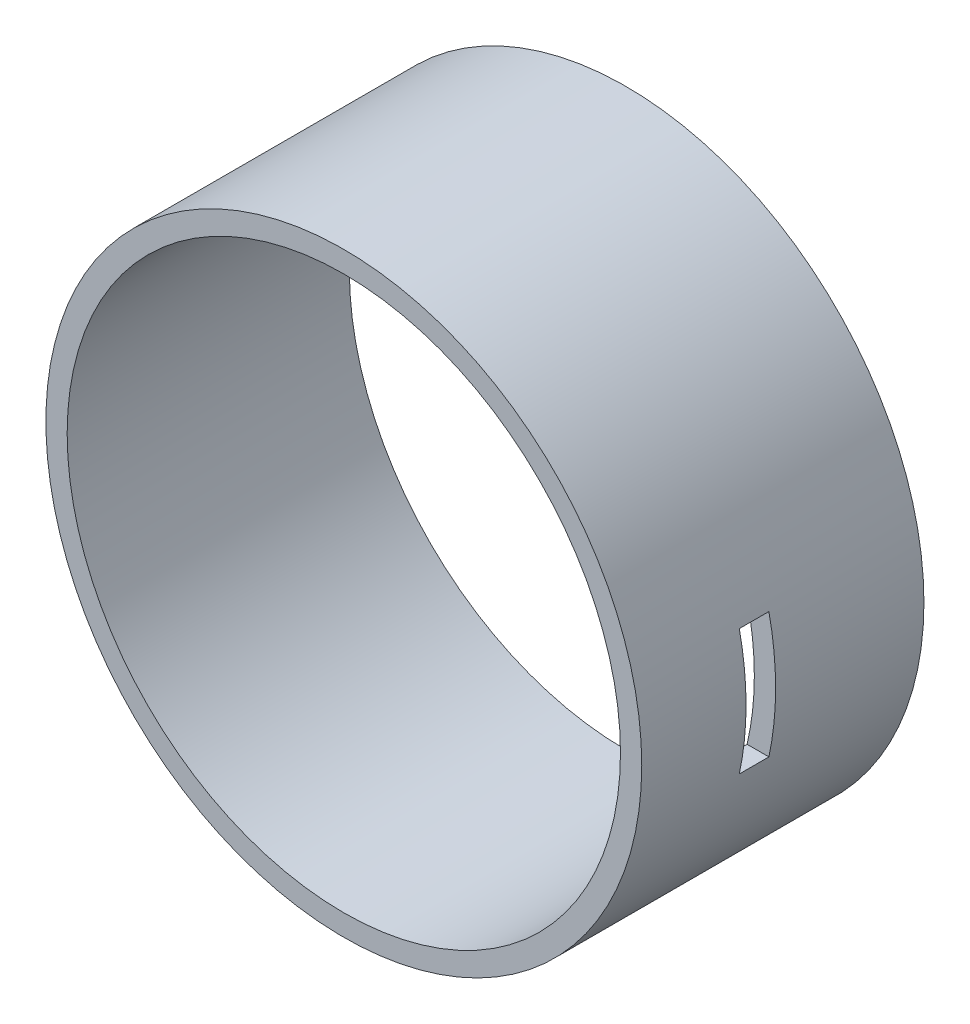
ISO-10303-21;
HEADER;
FILE_DESCRIPTION(('STEP AP214'),'2;1');
FILE_NAME('part.step','',(''),(''),'','','');
FILE_SCHEMA(('AUTOMOTIVE_DESIGN { 1 0 10303 214 1 1 1 1 }'));
ENDSEC;
DATA;
#1=APPLICATION_CONTEXT('core data for automotive mechanical design processes');
#2=APPLICATION_PROTOCOL_DEFINITION('international standard','automotive_design',2000,#1);
#3=PRODUCT_CONTEXT('',#1,'mechanical');
#4=PRODUCT('Part','Part','',(#3));
#5=PRODUCT_RELATED_PRODUCT_CATEGORY('part','',(#4));
#6=PRODUCT_DEFINITION_FORMATION('','',#4);
#7=PRODUCT_DEFINITION_CONTEXT('part definition',#1,'design');
#8=PRODUCT_DEFINITION('design','',#6,#7);
#9=PRODUCT_DEFINITION_SHAPE('','',#8);
#10=(LENGTH_UNIT() NAMED_UNIT(*) SI_UNIT(.MILLI.,.METRE.));
#11=(NAMED_UNIT(*) PLANE_ANGLE_UNIT() SI_UNIT($,.RADIAN.));
#12=(NAMED_UNIT(*) SI_UNIT($,.STERADIAN.) SOLID_ANGLE_UNIT());
#13=UNCERTAINTY_MEASURE_WITH_UNIT(LENGTH_MEASURE(1.E-05),#10,'distance_accuracy_value','');
#14=(GEOMETRIC_REPRESENTATION_CONTEXT(3) GLOBAL_UNCERTAINTY_ASSIGNED_CONTEXT((#13)) GLOBAL_UNIT_ASSIGNED_CONTEXT((#10,
#11,#12)) REPRESENTATION_CONTEXT('',''));
#15=CARTESIAN_POINT('',(0.,0.,0.));
#16=DIRECTION('',(0.,0.,1.));
#17=DIRECTION('',(1.,0.,0.));
#18=AXIS2_PLACEMENT_3D('',#15,#16,#17);
#19=CARTESIAN_POINT('',(0.,0.,132.6));
#20=DIRECTION('',(0.,0.,-1.));
#21=DIRECTION('',(-1.,0.,0.));
#22=AXIS2_PLACEMENT_3D('',#19,#20,#21);
#23=CYLINDRICAL_SURFACE('',#22,140.);
#24=CARTESIAN_POINT('',(0.,0.,132.6));
#25=DIRECTION('',(0.,0.,1.));
#26=DIRECTION('',(1.,0.,0.));
#27=AXIS2_PLACEMENT_3D('',#24,#25,#26);
#28=CIRCLE('',#27,140.);
#29=CARTESIAN_POINT('',(140.,0.,132.6));
#30=VERTEX_POINT('',#29);
#31=EDGE_CURVE('E189',#30,#30,#28,.T.);
#32=ORIENTED_EDGE('',*,*,#31,.F.);
#33=EDGE_LOOP('',(#32));
#34=FACE_BOUND('',#33,.T.);
#35=CARTESIAN_POINT('',(0.,0.,0.));
#36=DIRECTION('',(0.,0.,1.));
#37=DIRECTION('',(1.,0.,0.));
#38=AXIS2_PLACEMENT_3D('',#35,#36,#37);
#39=CIRCLE('',#38,140.);
#40=CARTESIAN_POINT('',(140.,0.,0.));
#41=VERTEX_POINT('',#40);
#42=EDGE_CURVE('E186',#41,#41,#39,.T.);
#43=ORIENTED_EDGE('',*,*,#42,.T.);
#44=EDGE_LOOP('',(#43));
#45=FACE_BOUND('',#44,.T.);
#46=CARTESIAN_POINT('',(0.,0.,69.7));
#47=DIRECTION('',(0.,0.,1.));
#48=DIRECTION('',(1.,0.,0.));
#49=AXIS2_PLACEMENT_3D('',#46,#47,#48);
#50=CIRCLE('',#49,140.);
#51=CARTESIAN_POINT('',(136.840488799916,-29.575,69.7));
#52=VERTEX_POINT('',#51);
#53=CARTESIAN_POINT('',(136.840488799916,29.575,69.7));
#54=VERTEX_POINT('',#53);
#55=EDGE_CURVE('E112',#52,#54,#50,.T.);
#56=ORIENTED_EDGE('',*,*,#55,.F.);
#57=DIRECTION('',(0.,0.,-1.));
#58=VECTOR('',#57,1.);
#59=CARTESIAN_POINT('',(136.840488799916,-29.575,132.6));
#60=LINE('',#59,#58);
#61=CARTESIAN_POINT('',(136.840488799916,-29.575,83.6));
#62=VERTEX_POINT('',#61);
#63=EDGE_CURVE('E113',#62,#52,#60,.T.);
#64=ORIENTED_EDGE('',*,*,#63,.F.);
#65=CARTESIAN_POINT('',(0.,0.,83.6));
#66=DIRECTION('',(0.,0.,-1.));
#67=DIRECTION('',(0.,1.,0.));
#68=AXIS2_PLACEMENT_3D('',#65,#66,#67);
#69=CIRCLE('',#68,140.);
#70=CARTESIAN_POINT('',(136.840488799916,29.575,83.6));
#71=VERTEX_POINT('',#70);
#72=EDGE_CURVE('E59',#71,#62,#69,.T.);
#73=ORIENTED_EDGE('',*,*,#72,.F.);
#74=DIRECTION('',(0.,0.,-1.));
#75=VECTOR('',#74,1.);
#76=CARTESIAN_POINT('',(136.840488799916,29.575,132.6));
#77=LINE('',#76,#75);
#78=EDGE_CURVE('E114',#54,#71,#77,.F.);
#79=ORIENTED_EDGE('',*,*,#78,.F.);
#80=EDGE_LOOP('',(#56,#64,#73,#79));
#81=FACE_BOUND('',#80,.T.);
#82=ADVANCED_FACE('F45',(#34,#45,#81),#23,.T.);
#83=CARTESIAN_POINT('',(0.,0.,132.6));
#84=DIRECTION('',(0.,0.,-1.));
#85=DIRECTION('',(-1.,0.,0.));
#86=AXIS2_PLACEMENT_3D('',#83,#84,#85);
#87=CYLINDRICAL_SURFACE('',#86,130.);
#88=CARTESIAN_POINT('',(0.,0.,132.6));
#89=DIRECTION('',(0.,0.,1.));
#90=DIRECTION('',(1.,0.,0.));
#91=AXIS2_PLACEMENT_3D('',#88,#89,#90);
#92=CIRCLE('',#91,130.);
#93=CARTESIAN_POINT('',(130.,0.,132.6));
#94=VERTEX_POINT('',#93);
#95=EDGE_CURVE('E183',#94,#94,#92,.T.);
#96=ORIENTED_EDGE('',*,*,#95,.T.);
#97=EDGE_LOOP('',(#96));
#98=FACE_BOUND('',#97,.T.);
#99=CARTESIAN_POINT('',(0.,0.,0.));
#100=DIRECTION('',(0.,0.,1.));
#101=DIRECTION('',(1.,0.,0.));
#102=AXIS2_PLACEMENT_3D('',#99,#100,#101);
#103=CIRCLE('',#102,130.);
#104=CARTESIAN_POINT('',(130.,0.,0.));
#105=VERTEX_POINT('',#104);
#106=EDGE_CURVE('E182',#105,#105,#103,.T.);
#107=ORIENTED_EDGE('',*,*,#106,.F.);
#108=EDGE_LOOP('',(#107));
#109=FACE_BOUND('',#108,.T.);
#110=DIRECTION('',(0.,0.,-1.));
#111=VECTOR('',#110,1.);
#112=CARTESIAN_POINT('',(126.591150460844,-29.575,132.6));
#113=LINE('',#112,#111);
#114=CARTESIAN_POINT('',(126.591150460844,-29.575,83.6));
#115=VERTEX_POINT('',#114);
#116=CARTESIAN_POINT('',(126.591150460844,-29.575,69.7));
#117=VERTEX_POINT('',#116);
#118=EDGE_CURVE('E192',#115,#117,#113,.T.);
#119=ORIENTED_EDGE('',*,*,#118,.T.);
#120=CARTESIAN_POINT('',(0.,0.,69.7));
#121=DIRECTION('',(0.,0.,1.));
#122=DIRECTION('',(1.,0.,0.));
#123=AXIS2_PLACEMENT_3D('',#120,#121,#122);
#124=CIRCLE('',#123,130.);
#125=CARTESIAN_POINT('',(126.591150460844,29.575,69.7));
#126=VERTEX_POINT('',#125);
#127=EDGE_CURVE('E12',#117,#126,#124,.T.);
#128=ORIENTED_EDGE('',*,*,#127,.T.);
#129=DIRECTION('',(0.,0.,-1.));
#130=VECTOR('',#129,1.);
#131=CARTESIAN_POINT('',(126.591150460844,29.575,132.6));
#132=LINE('',#131,#130);
#133=CARTESIAN_POINT('',(126.591150460844,29.575,83.6));
#134=VERTEX_POINT('',#133);
#135=EDGE_CURVE('E52',#126,#134,#132,.F.);
#136=ORIENTED_EDGE('',*,*,#135,.T.);
#137=CARTESIAN_POINT('',(0.,0.,83.6));
#138=DIRECTION('',(0.,0.,-1.));
#139=DIRECTION('',(0.,1.,0.));
#140=AXIS2_PLACEMENT_3D('',#137,#138,#139);
#141=CIRCLE('',#140,130.);
#142=EDGE_CURVE('E196',#134,#115,#141,.T.);
#143=ORIENTED_EDGE('',*,*,#142,.T.);
#144=EDGE_LOOP('',(#119,#128,#136,#143));
#145=FACE_BOUND('',#144,.T.);
#146=ADVANCED_FACE('F200',(#98,#109,#145),#87,.F.);
#147=CARTESIAN_POINT('',(0.,0.,132.6));
#148=DIRECTION('',(0.,0.,1.));
#149=DIRECTION('',(1.,0.,0.));
#150=AXIS2_PLACEMENT_3D('',#147,#148,#149);
#151=PLANE('',#150);
#152=ORIENTED_EDGE('',*,*,#31,.T.);
#153=EDGE_LOOP('',(#152));
#154=FACE_BOUND('',#153,.T.);
#155=ORIENTED_EDGE('',*,*,#95,.F.);
#156=EDGE_LOOP('',(#155));
#157=FACE_BOUND('',#156,.T.);
#158=ADVANCED_FACE('F217',(#154,#157),#151,.T.);
#159=CARTESIAN_POINT('',(0.,0.,0.));
#160=DIRECTION('',(0.,0.,1.));
#161=DIRECTION('',(1.,0.,0.));
#162=AXIS2_PLACEMENT_3D('',#159,#160,#161);
#163=PLANE('',#162);
#164=CARTESIAN_POINT('',(0.,135.,0.));
#165=DIRECTION('',(0.,0.,-1.));
#166=DIRECTION('',(-1.,0.,0.));
#167=AXIS2_PLACEMENT_3D('',#164,#165,#166);
#168=CIRCLE('',#167,1.65);
#169=CARTESIAN_POINT('',(-1.65,135.,0.));
#170=VERTEX_POINT('',#169);
#171=EDGE_CURVE('E118',#170,#170,#168,.T.);
#172=ORIENTED_EDGE('',*,*,#171,.F.);
#173=EDGE_LOOP('',(#172));
#174=FACE_BOUND('',#173,.T.);
#175=CARTESIAN_POINT('',(-135.,0.,0.));
#176=DIRECTION('',(0.,0.,-1.));
#177=DIRECTION('',(-1.,0.,0.));
#178=AXIS2_PLACEMENT_3D('',#175,#176,#177);
#179=CIRCLE('',#178,1.64999999999998);
#180=CARTESIAN_POINT('',(-136.65,0.,0.));
#181=VERTEX_POINT('',#180);
#182=EDGE_CURVE('E140',#181,#181,#179,.T.);
#183=ORIENTED_EDGE('',*,*,#182,.F.);
#184=EDGE_LOOP('',(#183));
#185=FACE_BOUND('',#184,.T.);
#186=CARTESIAN_POINT('',(-95.5,95.5,0.));
#187=DIRECTION('',(0.,0.,-1.));
#188=DIRECTION('',(-1.,0.,0.));
#189=AXIS2_PLACEMENT_3D('',#186,#187,#188);
#190=CIRCLE('',#189,1.65);
#191=CARTESIAN_POINT('',(-97.15,95.5,0.));
#192=VERTEX_POINT('',#191);
#193=EDGE_CURVE('E146',#192,#192,#190,.T.);
#194=ORIENTED_EDGE('',*,*,#193,.F.);
#195=EDGE_LOOP('',(#194));
#196=FACE_BOUND('',#195,.T.);
#197=CARTESIAN_POINT('',(-95.5,-95.5,0.));
#198=DIRECTION('',(0.,0.,-1.));
#199=DIRECTION('',(-1.,0.,0.));
#200=AXIS2_PLACEMENT_3D('',#197,#198,#199);
#201=CIRCLE('',#200,1.65);
#202=CARTESIAN_POINT('',(-97.15,-95.5,0.));
#203=VERTEX_POINT('',#202);
#204=EDGE_CURVE('E152',#203,#203,#201,.T.);
#205=ORIENTED_EDGE('',*,*,#204,.F.);
#206=EDGE_LOOP('',(#205));
#207=FACE_BOUND('',#206,.T.);
#208=CARTESIAN_POINT('',(0.,-135.,0.));
#209=DIRECTION('',(0.,0.,-1.));
#210=DIRECTION('',(-1.,0.,0.));
#211=AXIS2_PLACEMENT_3D('',#208,#209,#210);
#212=CIRCLE('',#211,1.65);
#213=CARTESIAN_POINT('',(-1.65,-135.,0.));
#214=VERTEX_POINT('',#213);
#215=EDGE_CURVE('E158',#214,#214,#212,.T.);
#216=ORIENTED_EDGE('',*,*,#215,.F.);
#217=EDGE_LOOP('',(#216));
#218=FACE_BOUND('',#217,.T.);
#219=CARTESIAN_POINT('',(95.5,-95.5,0.));
#220=DIRECTION('',(0.,0.,-1.));
#221=DIRECTION('',(-1.,0.,0.));
#222=AXIS2_PLACEMENT_3D('',#219,#220,#221);
#223=CIRCLE('',#222,1.65);
#224=CARTESIAN_POINT('',(93.85,-95.5,0.));
#225=VERTEX_POINT('',#224);
#226=EDGE_CURVE('E164',#225,#225,#223,.T.);
#227=ORIENTED_EDGE('',*,*,#226,.F.);
#228=EDGE_LOOP('',(#227));
#229=FACE_BOUND('',#228,.T.);
#230=CARTESIAN_POINT('',(135.,0.,0.));
#231=DIRECTION('',(0.,0.,-1.));
#232=DIRECTION('',(-1.,0.,0.));
#233=AXIS2_PLACEMENT_3D('',#230,#231,#232);
#234=CIRCLE('',#233,1.64999999999998);
#235=CARTESIAN_POINT('',(133.35,0.,0.));
#236=VERTEX_POINT('',#235);
#237=EDGE_CURVE('E170',#236,#236,#234,.T.);
#238=ORIENTED_EDGE('',*,*,#237,.F.);
#239=EDGE_LOOP('',(#238));
#240=FACE_BOUND('',#239,.T.);
#241=CARTESIAN_POINT('',(95.5,95.5,0.));
#242=DIRECTION('',(0.,0.,-1.));
#243=DIRECTION('',(-1.,0.,0.));
#244=AXIS2_PLACEMENT_3D('',#241,#242,#243);
#245=CIRCLE('',#244,1.65);
#246=CARTESIAN_POINT('',(93.85,95.5,0.));
#247=VERTEX_POINT('',#246);
#248=EDGE_CURVE('E176',#247,#247,#245,.T.);
#249=ORIENTED_EDGE('',*,*,#248,.F.);
#250=EDGE_LOOP('',(#249));
#251=FACE_BOUND('',#250,.T.);
#252=ORIENTED_EDGE('',*,*,#42,.F.);
#253=EDGE_LOOP('',(#252));
#254=FACE_BOUND('',#253,.T.);
#255=ORIENTED_EDGE('',*,*,#106,.T.);
#256=EDGE_LOOP('',(#255));
#257=FACE_BOUND('',#256,.T.);
#258=ADVANCED_FACE('F224',(#174,#185,#196,#207,#218,#229,#240,#251,#254,#257),#163,.F.);
#259=CARTESIAN_POINT('',(95.5,95.5,20.));
#260=DIRECTION('',(0.,0.,-1.));
#261=DIRECTION('',(-1.,0.,0.));
#262=AXIS2_PLACEMENT_3D('',#259,#260,#261);
#263=CONICAL_SURFACE('',#262,1.65,1.02974425867665);
#264=CARTESIAN_POINT('',(95.5,95.5,20.9914200213955));
#265=VERTEX_POINT('',#264);
#266=VERTEX_LOOP('',#265);
#267=FACE_BOUND('',#266,.T.);
#268=CARTESIAN_POINT('',(95.5,95.5,20.));
#269=DIRECTION('',(0.,0.,-1.));
#270=DIRECTION('',(-1.,0.,0.));
#271=AXIS2_PLACEMENT_3D('',#268,#269,#270);
#272=CIRCLE('',#271,1.65);
#273=CARTESIAN_POINT('',(93.85,95.5,20.));
#274=VERTEX_POINT('',#273);
#275=EDGE_CURVE('E179',#274,#274,#272,.T.);
#276=ORIENTED_EDGE('',*,*,#275,.T.);
#277=EDGE_LOOP('',(#276));
#278=FACE_BOUND('',#277,.T.);
#279=ADVANCED_FACE('F227',(#267,#278),#263,.F.);
#280=CARTESIAN_POINT('',(95.5,95.5,0.));
#281=DIRECTION('',(0.,0.,-1.));
#282=DIRECTION('',(-1.,0.,0.));
#283=AXIS2_PLACEMENT_3D('',#280,#281,#282);
#284=CYLINDRICAL_SURFACE('',#283,1.65);
#285=ORIENTED_EDGE('',*,*,#275,.F.);
#286=EDGE_LOOP('',(#285));
#287=FACE_BOUND('',#286,.T.);
#288=ORIENTED_EDGE('',*,*,#248,.T.);
#289=EDGE_LOOP('',(#288));
#290=FACE_BOUND('',#289,.T.);
#291=ADVANCED_FACE('F235',(#287,#290),#284,.F.);
#292=CARTESIAN_POINT('',(135.,0.,20.));
#293=DIRECTION('',(0.,0.,-1.));
#294=DIRECTION('',(-1.,0.,0.));
#295=AXIS2_PLACEMENT_3D('',#292,#293,#294);
#296=CONICAL_SURFACE('',#295,1.64999999999998,1.02974425867665);
#297=CARTESIAN_POINT('',(135.,0.,20.9914200213955));
#298=VERTEX_POINT('',#297);
#299=VERTEX_LOOP('',#298);
#300=FACE_BOUND('',#299,.T.);
#301=CARTESIAN_POINT('',(135.,0.,20.));
#302=DIRECTION('',(0.,0.,-1.));
#303=DIRECTION('',(-1.,0.,0.));
#304=AXIS2_PLACEMENT_3D('',#301,#302,#303);
#305=CIRCLE('',#304,1.64999999999998);
#306=CARTESIAN_POINT('',(133.35,0.,20.));
#307=VERTEX_POINT('',#306);
#308=EDGE_CURVE('E173',#307,#307,#305,.T.);
#309=ORIENTED_EDGE('',*,*,#308,.T.);
#310=EDGE_LOOP('',(#309));
#311=FACE_BOUND('',#310,.T.);
#312=ADVANCED_FACE('F245',(#300,#311),#296,.F.);
#313=CARTESIAN_POINT('',(135.,0.,0.));
#314=DIRECTION('',(0.,0.,-1.));
#315=DIRECTION('',(-1.,0.,0.));
#316=AXIS2_PLACEMENT_3D('',#313,#314,#315);
#317=CYLINDRICAL_SURFACE('',#316,1.64999999999998);
#318=ORIENTED_EDGE('',*,*,#308,.F.);
#319=EDGE_LOOP('',(#318));
#320=FACE_BOUND('',#319,.T.);
#321=ORIENTED_EDGE('',*,*,#237,.T.);
#322=EDGE_LOOP('',(#321));
#323=FACE_BOUND('',#322,.T.);
#324=ADVANCED_FACE('F249',(#320,#323),#317,.F.);
#325=CARTESIAN_POINT('',(95.5,-95.5,20.));
#326=DIRECTION('',(0.,0.,-1.));
#327=DIRECTION('',(-1.,0.,0.));
#328=AXIS2_PLACEMENT_3D('',#325,#326,#327);
#329=CONICAL_SURFACE('',#328,1.65,1.02974425867665);
#330=CARTESIAN_POINT('',(95.5,-95.5,20.9914200213955));
#331=VERTEX_POINT('',#330);
#332=VERTEX_LOOP('',#331);
#333=FACE_BOUND('',#332,.T.);
#334=CARTESIAN_POINT('',(95.5,-95.5,20.));
#335=DIRECTION('',(0.,0.,-1.));
#336=DIRECTION('',(-1.,0.,0.));
#337=AXIS2_PLACEMENT_3D('',#334,#335,#336);
#338=CIRCLE('',#337,1.65);
#339=CARTESIAN_POINT('',(93.85,-95.5,20.));
#340=VERTEX_POINT('',#339);
#341=EDGE_CURVE('E167',#340,#340,#338,.T.);
#342=ORIENTED_EDGE('',*,*,#341,.T.);
#343=EDGE_LOOP('',(#342));
#344=FACE_BOUND('',#343,.T.);
#345=ADVANCED_FACE('F253',(#333,#344),#329,.F.);
#346=CARTESIAN_POINT('',(95.5,-95.5,0.));
#347=DIRECTION('',(0.,0.,-1.));
#348=DIRECTION('',(-1.,0.,0.));
#349=AXIS2_PLACEMENT_3D('',#346,#347,#348);
#350=CYLINDRICAL_SURFACE('',#349,1.65);
#351=ORIENTED_EDGE('',*,*,#341,.F.);
#352=EDGE_LOOP('',(#351));
#353=FACE_BOUND('',#352,.T.);
#354=ORIENTED_EDGE('',*,*,#226,.T.);
#355=EDGE_LOOP('',(#354));
#356=FACE_BOUND('',#355,.T.);
#357=ADVANCED_FACE('F257',(#353,#356),#350,.F.);
#358=CARTESIAN_POINT('',(0.,-135.,20.));
#359=DIRECTION('',(0.,0.,-1.));
#360=DIRECTION('',(-1.,0.,0.));
#361=AXIS2_PLACEMENT_3D('',#358,#359,#360);
#362=CONICAL_SURFACE('',#361,1.65,1.02974425867665);
#363=CARTESIAN_POINT('',(0.,-135.,20.9914200213955));
#364=VERTEX_POINT('',#363);
#365=VERTEX_LOOP('',#364);
#366=FACE_BOUND('',#365,.T.);
#367=CARTESIAN_POINT('',(0.,-135.,20.));
#368=DIRECTION('',(0.,0.,-1.));
#369=DIRECTION('',(-1.,0.,0.));
#370=AXIS2_PLACEMENT_3D('',#367,#368,#369);
#371=CIRCLE('',#370,1.65);
#372=CARTESIAN_POINT('',(-1.65,-135.,20.));
#373=VERTEX_POINT('',#372);
#374=EDGE_CURVE('E161',#373,#373,#371,.T.);
#375=ORIENTED_EDGE('',*,*,#374,.T.);
#376=EDGE_LOOP('',(#375));
#377=FACE_BOUND('',#376,.T.);
#378=ADVANCED_FACE('F261',(#366,#377),#362,.F.);
#379=CARTESIAN_POINT('',(0.,-135.,0.));
#380=DIRECTION('',(0.,0.,-1.));
#381=DIRECTION('',(-1.,0.,0.));
#382=AXIS2_PLACEMENT_3D('',#379,#380,#381);
#383=CYLINDRICAL_SURFACE('',#382,1.65);
#384=ORIENTED_EDGE('',*,*,#374,.F.);
#385=EDGE_LOOP('',(#384));
#386=FACE_BOUND('',#385,.T.);
#387=ORIENTED_EDGE('',*,*,#215,.T.);
#388=EDGE_LOOP('',(#387));
#389=FACE_BOUND('',#388,.T.);
#390=ADVANCED_FACE('F265',(#386,#389),#383,.F.);
#391=CARTESIAN_POINT('',(-95.5,-95.5,20.));
#392=DIRECTION('',(0.,0.,-1.));
#393=DIRECTION('',(-1.,0.,0.));
#394=AXIS2_PLACEMENT_3D('',#391,#392,#393);
#395=CONICAL_SURFACE('',#394,1.65,1.02974425867665);
#396=CARTESIAN_POINT('',(-95.5,-95.5,20.9914200213955));
#397=VERTEX_POINT('',#396);
#398=VERTEX_LOOP('',#397);
#399=FACE_BOUND('',#398,.T.);
#400=CARTESIAN_POINT('',(-95.5,-95.5,20.));
#401=DIRECTION('',(0.,0.,-1.));
#402=DIRECTION('',(-1.,0.,0.));
#403=AXIS2_PLACEMENT_3D('',#400,#401,#402);
#404=CIRCLE('',#403,1.65);
#405=CARTESIAN_POINT('',(-97.15,-95.5,20.));
#406=VERTEX_POINT('',#405);
#407=EDGE_CURVE('E155',#406,#406,#404,.T.);
#408=ORIENTED_EDGE('',*,*,#407,.T.);
#409=EDGE_LOOP('',(#408));
#410=FACE_BOUND('',#409,.T.);
#411=ADVANCED_FACE('F269',(#399,#410),#395,.F.);
#412=CARTESIAN_POINT('',(-95.5,-95.5,0.));
#413=DIRECTION('',(0.,0.,-1.));
#414=DIRECTION('',(-1.,0.,0.));
#415=AXIS2_PLACEMENT_3D('',#412,#413,#414);
#416=CYLINDRICAL_SURFACE('',#415,1.65);
#417=ORIENTED_EDGE('',*,*,#407,.F.);
#418=EDGE_LOOP('',(#417));
#419=FACE_BOUND('',#418,.T.);
#420=ORIENTED_EDGE('',*,*,#204,.T.);
#421=EDGE_LOOP('',(#420));
#422=FACE_BOUND('',#421,.T.);
#423=ADVANCED_FACE('F273',(#419,#422),#416,.F.);
#424=CARTESIAN_POINT('',(-95.5,95.5,20.));
#425=DIRECTION('',(0.,0.,-1.));
#426=DIRECTION('',(-1.,0.,0.));
#427=AXIS2_PLACEMENT_3D('',#424,#425,#426);
#428=CONICAL_SURFACE('',#427,1.65,1.02974425867665);
#429=CARTESIAN_POINT('',(-95.5,95.5,20.9914200213955));
#430=VERTEX_POINT('',#429);
#431=VERTEX_LOOP('',#430);
#432=FACE_BOUND('',#431,.T.);
#433=CARTESIAN_POINT('',(-95.5,95.5,20.));
#434=DIRECTION('',(0.,0.,-1.));
#435=DIRECTION('',(-1.,0.,0.));
#436=AXIS2_PLACEMENT_3D('',#433,#434,#435);
#437=CIRCLE('',#436,1.65);
#438=CARTESIAN_POINT('',(-97.15,95.5,20.));
#439=VERTEX_POINT('',#438);
#440=EDGE_CURVE('E149',#439,#439,#437,.T.);
#441=ORIENTED_EDGE('',*,*,#440,.T.);
#442=EDGE_LOOP('',(#441));
#443=FACE_BOUND('',#442,.T.);
#444=ADVANCED_FACE('F277',(#432,#443),#428,.F.);
#445=CARTESIAN_POINT('',(-95.5,95.5,0.));
#446=DIRECTION('',(0.,0.,-1.));
#447=DIRECTION('',(-1.,0.,0.));
#448=AXIS2_PLACEMENT_3D('',#445,#446,#447);
#449=CYLINDRICAL_SURFACE('',#448,1.65);
#450=ORIENTED_EDGE('',*,*,#440,.F.);
#451=EDGE_LOOP('',(#450));
#452=FACE_BOUND('',#451,.T.);
#453=ORIENTED_EDGE('',*,*,#193,.T.);
#454=EDGE_LOOP('',(#453));
#455=FACE_BOUND('',#454,.T.);
#456=ADVANCED_FACE('F281',(#452,#455),#449,.F.);
#457=CARTESIAN_POINT('',(-135.,0.,20.));
#458=DIRECTION('',(0.,0.,-1.));
#459=DIRECTION('',(-1.,0.,0.));
#460=AXIS2_PLACEMENT_3D('',#457,#458,#459);
#461=CONICAL_SURFACE('',#460,1.64999999999998,1.02974425867665);
#462=CARTESIAN_POINT('',(-135.,0.,20.9914200213955));
#463=VERTEX_POINT('',#462);
#464=VERTEX_LOOP('',#463);
#465=FACE_BOUND('',#464,.T.);
#466=CARTESIAN_POINT('',(-135.,0.,20.));
#467=DIRECTION('',(0.,0.,-1.));
#468=DIRECTION('',(-1.,0.,0.));
#469=AXIS2_PLACEMENT_3D('',#466,#467,#468);
#470=CIRCLE('',#469,1.64999999999998);
#471=CARTESIAN_POINT('',(-136.65,0.,20.));
#472=VERTEX_POINT('',#471);
#473=EDGE_CURVE('E143',#472,#472,#470,.T.);
#474=ORIENTED_EDGE('',*,*,#473,.T.);
#475=EDGE_LOOP('',(#474));
#476=FACE_BOUND('',#475,.T.);
#477=ADVANCED_FACE('F285',(#465,#476),#461,.F.);
#478=CARTESIAN_POINT('',(-135.,0.,0.));
#479=DIRECTION('',(0.,0.,-1.));
#480=DIRECTION('',(-1.,0.,0.));
#481=AXIS2_PLACEMENT_3D('',#478,#479,#480);
#482=CYLINDRICAL_SURFACE('',#481,1.64999999999998);
#483=ORIENTED_EDGE('',*,*,#473,.F.);
#484=EDGE_LOOP('',(#483));
#485=FACE_BOUND('',#484,.T.);
#486=ORIENTED_EDGE('',*,*,#182,.T.);
#487=EDGE_LOOP('',(#486));
#488=FACE_BOUND('',#487,.T.);
#489=ADVANCED_FACE('F289',(#485,#488),#482,.F.);
#490=CARTESIAN_POINT('',(0.,135.,20.));
#491=DIRECTION('',(0.,0.,-1.));
#492=DIRECTION('',(-1.,0.,0.));
#493=AXIS2_PLACEMENT_3D('',#490,#491,#492);
#494=CONICAL_SURFACE('',#493,1.65,1.02974425867665);
#495=CARTESIAN_POINT('',(0.,135.,20.9914200213955));
#496=VERTEX_POINT('',#495);
#497=VERTEX_LOOP('',#496);
#498=FACE_BOUND('',#497,.T.);
#499=CARTESIAN_POINT('',(0.,135.,20.));
#500=DIRECTION('',(0.,0.,-1.));
#501=DIRECTION('',(-1.,0.,0.));
#502=AXIS2_PLACEMENT_3D('',#499,#500,#501);
#503=CIRCLE('',#502,1.65);
#504=CARTESIAN_POINT('',(-1.65,135.,20.));
#505=VERTEX_POINT('',#504);
#506=EDGE_CURVE('E137',#505,#505,#503,.T.);
#507=ORIENTED_EDGE('',*,*,#506,.T.);
#508=EDGE_LOOP('',(#507));
#509=FACE_BOUND('',#508,.T.);
#510=ADVANCED_FACE('F293',(#498,#509),#494,.F.);
#511=CARTESIAN_POINT('',(0.,135.,0.));
#512=DIRECTION('',(0.,0.,-1.));
#513=DIRECTION('',(-1.,0.,0.));
#514=AXIS2_PLACEMENT_3D('',#511,#512,#513);
#515=CYLINDRICAL_SURFACE('',#514,1.65);
#516=ORIENTED_EDGE('',*,*,#506,.F.);
#517=EDGE_LOOP('',(#516));
#518=FACE_BOUND('',#517,.T.);
#519=ORIENTED_EDGE('',*,*,#171,.T.);
#520=EDGE_LOOP('',(#519));
#521=FACE_BOUND('',#520,.T.);
#522=ADVANCED_FACE('F297',(#518,#521),#515,.F.);
#523=CARTESIAN_POINT('',(140.,29.575,69.7));
#524=DIRECTION('',(0.,0.,1.));
#525=DIRECTION('',(1.,0.,0.));
#526=AXIS2_PLACEMENT_3D('',#523,#524,#525);
#527=PLANE('',#526);
#528=ORIENTED_EDGE('',*,*,#55,.T.);
#529=DIRECTION('',(-1.,0.,0.));
#530=VECTOR('',#529,1.);
#531=CARTESIAN_POINT('',(140.,29.575,69.7));
#532=LINE('',#531,#530);
#533=EDGE_CURVE('E122',#54,#126,#532,.T.);
#534=ORIENTED_EDGE('',*,*,#533,.T.);
#535=ORIENTED_EDGE('',*,*,#127,.F.);
#536=DIRECTION('',(-1.,0.,0.));
#537=VECTOR('',#536,1.);
#538=CARTESIAN_POINT('',(140.,-29.575,69.7));
#539=LINE('',#538,#537);
#540=EDGE_CURVE('E67',#52,#117,#539,.T.);
#541=ORIENTED_EDGE('',*,*,#540,.F.);
#542=EDGE_LOOP('',(#528,#534,#535,#541));
#543=FACE_BOUND('',#542,.T.);
#544=ADVANCED_FACE('F124',(#543),#527,.T.);
#545=CARTESIAN_POINT('',(140.,29.575,69.7));
#546=DIRECTION('',(0.,-1.,0.));
#547=DIRECTION('',(0.,0.,-1.));
#548=AXIS2_PLACEMENT_3D('',#545,#546,#547);
#549=PLANE('',#548);
#550=ORIENTED_EDGE('',*,*,#78,.T.);
#551=DIRECTION('',(-1.,0.,0.));
#552=VECTOR('',#551,1.);
#553=CARTESIAN_POINT('',(140.,29.575,83.6));
#554=LINE('',#553,#552);
#555=EDGE_CURVE('E127',#71,#134,#554,.T.);
#556=ORIENTED_EDGE('',*,*,#555,.T.);
#557=ORIENTED_EDGE('',*,*,#135,.F.);
#558=ORIENTED_EDGE('',*,*,#533,.F.);
#559=EDGE_LOOP('',(#550,#556,#557,#558));
#560=FACE_BOUND('',#559,.T.);
#561=ADVANCED_FACE('F202',(#560),#549,.T.);
#562=CARTESIAN_POINT('',(140.,29.575,83.6));
#563=DIRECTION('',(0.,0.,-1.));
#564=DIRECTION('',(0.,1.,0.));
#565=AXIS2_PLACEMENT_3D('',#562,#563,#564);
#566=PLANE('',#565);
#567=ORIENTED_EDGE('',*,*,#72,.T.);
#568=DIRECTION('',(-1.,0.,0.));
#569=VECTOR('',#568,1.);
#570=CARTESIAN_POINT('',(140.,-29.575,83.6));
#571=LINE('',#570,#569);
#572=EDGE_CURVE('E121',#62,#115,#571,.T.);
#573=ORIENTED_EDGE('',*,*,#572,.T.);
#574=ORIENTED_EDGE('',*,*,#142,.F.);
#575=ORIENTED_EDGE('',*,*,#555,.F.);
#576=EDGE_LOOP('',(#567,#573,#574,#575));
#577=FACE_BOUND('',#576,.T.);
#578=ADVANCED_FACE('F203',(#577),#566,.T.);
#579=CARTESIAN_POINT('',(140.,-29.575,69.7));
#580=DIRECTION('',(0.,1.,0.));
#581=DIRECTION('',(0.,0.,1.));
#582=AXIS2_PLACEMENT_3D('',#579,#580,#581);
#583=PLANE('',#582);
#584=ORIENTED_EDGE('',*,*,#63,.T.);
#585=ORIENTED_EDGE('',*,*,#540,.T.);
#586=ORIENTED_EDGE('',*,*,#118,.F.);
#587=ORIENTED_EDGE('',*,*,#572,.F.);
#588=EDGE_LOOP('',(#584,#585,#586,#587));
#589=FACE_BOUND('',#588,.T.);
#590=ADVANCED_FACE('F120',(#589),#583,.T.);
#591=CLOSED_SHELL('',(#82,#146,#158,#258,#279,#291,#312,#324,#345,#357,#378,#390,#411,#423,#444,
#456,#477,#489,#510,#522,#544,#561,#578,#590));
#592=MANIFOLD_SOLID_BREP('B2',#591);
#593=ADVANCED_BREP_SHAPE_REPRESENTATION('',(#18,#592),#14);
#594=SHAPE_DEFINITION_REPRESENTATION(#9,#593);
ENDSEC;
END-ISO-10303-21;
